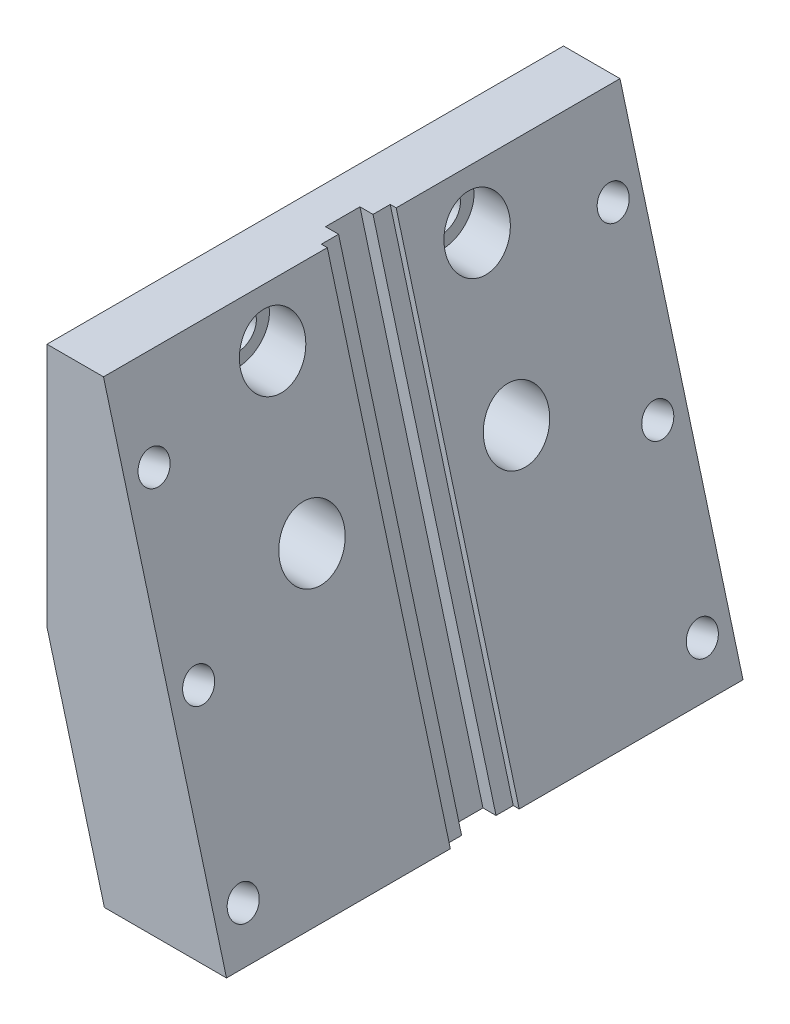
ISO-10303-21;
HEADER;
FILE_DESCRIPTION(('STEP AP214'),'2;1');
FILE_NAME('part.step','',(''),(''),'','','');
FILE_SCHEMA(('AUTOMOTIVE_DESIGN { 1 0 10303 214 1 1 1 1 }'));
ENDSEC;
DATA;
#1=APPLICATION_CONTEXT('core data for automotive mechanical design processes');
#2=APPLICATION_PROTOCOL_DEFINITION('international standard','automotive_design',2000,#1);
#3=PRODUCT_CONTEXT('',#1,'mechanical');
#4=PRODUCT('Part','Part','',(#3));
#5=PRODUCT_RELATED_PRODUCT_CATEGORY('part','',(#4));
#6=PRODUCT_DEFINITION_FORMATION('','',#4);
#7=PRODUCT_DEFINITION_CONTEXT('part definition',#1,'design');
#8=PRODUCT_DEFINITION('design','',#6,#7);
#9=PRODUCT_DEFINITION_SHAPE('','',#8);
#10=(LENGTH_UNIT() NAMED_UNIT(*) SI_UNIT(.MILLI.,.METRE.));
#11=(NAMED_UNIT(*) PLANE_ANGLE_UNIT() SI_UNIT($,.RADIAN.));
#12=(NAMED_UNIT(*) SI_UNIT($,.STERADIAN.) SOLID_ANGLE_UNIT());
#13=UNCERTAINTY_MEASURE_WITH_UNIT(LENGTH_MEASURE(1.E-05),#10,'distance_accuracy_value','');
#14=(GEOMETRIC_REPRESENTATION_CONTEXT(3) GLOBAL_UNCERTAINTY_ASSIGNED_CONTEXT((#13)) GLOBAL_UNIT_ASSIGNED_CONTEXT((#10,
#11,#12)) REPRESENTATION_CONTEXT('',''));
#15=CARTESIAN_POINT('',(0.,0.,0.));
#16=DIRECTION('',(0.,0.,1.));
#17=DIRECTION('',(1.,0.,0.));
#18=AXIS2_PLACEMENT_3D('',#15,#16,#17);
#19=CARTESIAN_POINT('',(-0.499999999999997,-4.26987298107783,8.89));
#20=DIRECTION('',(-1.,0.,0.));
#21=DIRECTION('',(0.,0.,1.));
#22=AXIS2_PLACEMENT_3D('',#19,#20,#21);
#23=CYLINDRICAL_SURFACE('',#22,1.63195);
#24=CARTESIAN_POINT('',(-10.5,-4.26987298107783,8.89));
#25=DIRECTION('',(1.,0.,0.));
#26=DIRECTION('',(0.,0.,-1.));
#27=AXIS2_PLACEMENT_3D('',#24,#25,#26);
#28=CIRCLE('',#27,1.63195);
#29=CARTESIAN_POINT('',(-10.5,-4.26987298107783,7.25805));
#30=VERTEX_POINT('',#29);
#31=EDGE_CURVE('E409',#30,#30,#28,.T.);
#32=ORIENTED_EDGE('',*,*,#31,.F.);
#33=EDGE_LOOP('',(#32));
#34=FACE_BOUND('',#33,.T.);
#35=CARTESIAN_POINT('',(-7.5,-4.26987298107783,8.89));
#36=DIRECTION('',(1.,0.,0.));
#37=DIRECTION('',(0.,0.,-1.));
#38=AXIS2_PLACEMENT_3D('',#35,#36,#37);
#39=CIRCLE('',#38,1.63195);
#40=CARTESIAN_POINT('',(-7.5,-4.26987298107783,7.25805));
#41=VERTEX_POINT('',#40);
#42=EDGE_CURVE('E425',#41,#41,#39,.T.);
#43=ORIENTED_EDGE('',*,*,#42,.T.);
#44=EDGE_LOOP('',(#43));
#45=FACE_BOUND('',#44,.T.);
#46=ADVANCED_FACE('F49',(#34,#45),#23,.F.);
#47=CARTESIAN_POINT('',(-0.499999999999997,-17.0698729810778,8.89));
#48=DIRECTION('',(-1.,0.,0.));
#49=DIRECTION('',(0.,0.,1.));
#50=AXIS2_PLACEMENT_3D('',#47,#48,#49);
#51=CYLINDRICAL_SURFACE('',#50,1.63195);
#52=CARTESIAN_POINT('',(-10.5,-17.0698729810778,8.89));
#53=DIRECTION('',(1.,0.,0.));
#54=DIRECTION('',(0.,0.,1.));
#55=AXIS2_PLACEMENT_3D('',#52,#53,#54);
#56=CIRCLE('',#55,1.63195);
#57=CARTESIAN_POINT('',(-10.5,-17.0698729810778,10.52195));
#58=VERTEX_POINT('',#57);
#59=EDGE_CURVE('E404',#58,#58,#56,.T.);
#60=ORIENTED_EDGE('',*,*,#59,.F.);
#61=EDGE_LOOP('',(#60));
#62=FACE_BOUND('',#61,.T.);
#63=CARTESIAN_POINT('',(-7.5,-17.0698729810778,8.89));
#64=DIRECTION('',(1.,0.,0.));
#65=DIRECTION('',(0.,0.,-1.));
#66=AXIS2_PLACEMENT_3D('',#63,#64,#65);
#67=CIRCLE('',#66,1.63195);
#68=CARTESIAN_POINT('',(-7.5,-17.0698729810778,7.25805));
#69=VERTEX_POINT('',#68);
#70=EDGE_CURVE('E421',#69,#69,#67,.T.);
#71=ORIENTED_EDGE('',*,*,#70,.T.);
#72=EDGE_LOOP('',(#71));
#73=FACE_BOUND('',#72,.T.);
#74=ADVANCED_FACE('F551',(#62,#73),#51,.F.);
#75=CARTESIAN_POINT('',(-0.499999999999997,-17.0698729810778,-8.89));
#76=DIRECTION('',(-1.,0.,0.));
#77=DIRECTION('',(0.,0.,1.));
#78=AXIS2_PLACEMENT_3D('',#75,#76,#77);
#79=CYLINDRICAL_SURFACE('',#78,1.63195);
#80=CARTESIAN_POINT('',(-10.5,-17.0698729810778,-8.89));
#81=DIRECTION('',(1.,0.,0.));
#82=DIRECTION('',(0.,0.,-1.));
#83=AXIS2_PLACEMENT_3D('',#80,#81,#82);
#84=CIRCLE('',#83,1.63195);
#85=CARTESIAN_POINT('',(-10.5,-17.0698729810778,-10.52195));
#86=VERTEX_POINT('',#85);
#87=EDGE_CURVE('E410',#86,#86,#84,.T.);
#88=ORIENTED_EDGE('',*,*,#87,.F.);
#89=EDGE_LOOP('',(#88));
#90=FACE_BOUND('',#89,.T.);
#91=CARTESIAN_POINT('',(-7.5,-17.0698729810778,-8.89));
#92=DIRECTION('',(1.,0.,0.));
#93=DIRECTION('',(0.,0.,-1.));
#94=AXIS2_PLACEMENT_3D('',#91,#92,#93);
#95=CIRCLE('',#94,1.63195);
#96=CARTESIAN_POINT('',(-7.5,-17.0698729810778,-10.52195));
#97=VERTEX_POINT('',#96);
#98=EDGE_CURVE('E426',#97,#97,#95,.T.);
#99=ORIENTED_EDGE('',*,*,#98,.T.);
#100=EDGE_LOOP('',(#99));
#101=FACE_BOUND('',#100,.T.);
#102=ADVANCED_FACE('F557',(#90,#101),#79,.F.);
#103=CARTESIAN_POINT('',(-0.499999999999997,-4.26987298107783,-8.89));
#104=DIRECTION('',(-1.,0.,0.));
#105=DIRECTION('',(0.,0.,1.));
#106=AXIS2_PLACEMENT_3D('',#103,#104,#105);
#107=CYLINDRICAL_SURFACE('',#106,1.63195);
#108=CARTESIAN_POINT('',(-10.5,-4.26987298107783,-8.89));
#109=DIRECTION('',(1.,0.,0.));
#110=DIRECTION('',(0.,0.,1.));
#111=AXIS2_PLACEMENT_3D('',#108,#109,#110);
#112=CIRCLE('',#111,1.63195);
#113=CARTESIAN_POINT('',(-10.5,-4.26987298107783,-7.25805));
#114=VERTEX_POINT('',#113);
#115=EDGE_CURVE('E359',#114,#114,#112,.T.);
#116=ORIENTED_EDGE('',*,*,#115,.F.);
#117=EDGE_LOOP('',(#116));
#118=FACE_BOUND('',#117,.T.);
#119=CARTESIAN_POINT('',(-7.5,-4.26987298107783,-8.89));
#120=DIRECTION('',(1.,0.,0.));
#121=DIRECTION('',(0.,0.,-1.));
#122=AXIS2_PLACEMENT_3D('',#119,#120,#121);
#123=CIRCLE('',#122,1.63195);
#124=CARTESIAN_POINT('',(-7.5,-4.26987298107783,-10.52195));
#125=VERTEX_POINT('',#124);
#126=EDGE_CURVE('E265',#125,#125,#123,.T.);
#127=ORIENTED_EDGE('',*,*,#126,.T.);
#128=EDGE_LOOP('',(#127));
#129=FACE_BOUND('',#128,.T.);
#130=ADVANCED_FACE('F565',(#118,#129),#107,.F.);
#131=CARTESIAN_POINT('',(-5.57695154586788,0.,0.));
#132=DIRECTION('',(0.965925826289066,0.258819045102528,0.));
#133=DIRECTION('',(0.,0.,1.));
#134=AXIS2_PLACEMENT_3D('',#131,#132,#133);
#135=PLANE('',#134);
#136=DIRECTION('',(-0.258819045102528,0.965925826289066,0.));
#137=VECTOR('',#136,1.);
#138=CARTESIAN_POINT('',(5.84903616136611,-42.6423666500534,-3.));
#139=LINE('',#138,#137);
#140=CARTESIAN_POINT('',(5.14101615137735,-40.,-3.));
#141=VERTEX_POINT('',#140);
#142=CARTESIAN_POINT('',(-5.57695154586788,0.,-3.));
#143=VERTEX_POINT('',#142);
#144=EDGE_CURVE('E198',#141,#143,#139,.T.);
#145=ORIENTED_EDGE('',*,*,#144,.F.);
#146=DIRECTION('',(0.,0.,1.));
#147=VECTOR('',#146,1.);
#148=CARTESIAN_POINT('',(5.14101615137735,-40.,0.));
#149=LINE('',#148,#147);
#150=CARTESIAN_POINT('',(5.14101615137734,-40.,-22.5));
#151=VERTEX_POINT('',#150);
#152=EDGE_CURVE('E214',#151,#141,#149,.T.);
#153=ORIENTED_EDGE('',*,*,#152,.F.);
#154=DIRECTION('',(0.258819045102528,-0.965925826289066,0.));
#155=VECTOR('',#154,1.);
#156=CARTESIAN_POINT('',(4.09326673973636,-36.0897459621556,-22.5));
#157=LINE('',#156,#155);
#158=CARTESIAN_POINT('',(-5.57695154586788,0.,-22.5));
#159=VERTEX_POINT('',#158);
#160=EDGE_CURVE('E234',#159,#151,#157,.T.);
#161=ORIENTED_EDGE('',*,*,#160,.F.);
#162=DIRECTION('',(0.,0.,-1.));
#163=VECTOR('',#162,1.);
#164=CARTESIAN_POINT('',(-5.57695154586788,0.,-22.5));
#165=LINE('',#164,#163);
#166=EDGE_CURVE('E215',#143,#159,#165,.T.);
#167=ORIENTED_EDGE('',*,*,#166,.F.);
#168=EDGE_LOOP('',(#145,#153,#161,#167));
#169=FACE_BOUND('',#168,.T.);
#170=CARTESIAN_POINT('',(-1.00215576247691,-17.0733702978664,-8.91));
#171=DIRECTION('',(0.965925826289066,0.258819045102528,0.));
#172=DIRECTION('',(0.258819045102528,-0.965925826289066,0.));
#173=AXIS2_PLACEMENT_3D('',#170,#171,#172);
#174=ELLIPSE('',#173,2.89256164806578,2.794);
#175=CARTESIAN_POINT('',(-0.253505718824335,-19.8673702978664,-8.91));
#176=VERTEX_POINT('',#175);
#177=EDGE_CURVE('E354',#176,#176,#174,.F.);
#178=ORIENTED_EDGE('',*,*,#177,.T.);
#179=EDGE_LOOP('',(#178));
#180=FACE_BOUND('',#179,.T.);
#181=CARTESIAN_POINT('',(-4.43284252880457,-4.26987298107784,-8.91));
#182=DIRECTION('',(0.965925826289066,0.258819045102528,0.));
#183=DIRECTION('',(0.258819045102528,-0.965925826289066,0.));
#184=AXIS2_PLACEMENT_3D('',#181,#182,#183);
#185=ELLIPSE('',#184,2.89256164806578,2.794);
#186=CARTESIAN_POINT('',(-3.68419248515199,-7.06387298107784,-8.91));
#187=VERTEX_POINT('',#186);
#188=EDGE_CURVE('E360',#187,#187,#185,.F.);
#189=ORIENTED_EDGE('',*,*,#188,.T.);
#190=EDGE_LOOP('',(#189));
#191=FACE_BOUND('',#190,.T.);
#192=CARTESIAN_POINT('',(0.213779508295674,-21.6113025071054,-20.));
#193=DIRECTION('',(0.965925826289069,0.258819045102519,0.));
#194=DIRECTION('',(-0.258819045102519,0.965925826289069,0.));
#195=AXIS2_PLACEMENT_3D('',#192,#193,#194);
#196=CIRCLE('',#195,1.35255);
#197=CARTESIAN_POINT('',(-0.136286191157738,-20.3048395307581,-20.));
#198=VERTEX_POINT('',#197);
#199=EDGE_CURVE('E371',#198,#198,#196,.T.);
#200=ORIENTED_EDGE('',*,*,#199,.F.);
#201=EDGE_LOOP('',(#200));
#202=FACE_BOUND('',#201,.T.);
#203=CARTESIAN_POINT('',(4.09606518483345,-36.1001899014415,-20.));
#204=DIRECTION('',(0.965925826289069,0.258819045102519,0.));
#205=DIRECTION('',(-0.258819045102519,0.965925826289069,0.));
#206=AXIS2_PLACEMENT_3D('',#203,#204,#205);
#207=CIRCLE('',#206,1.35255);
#208=CARTESIAN_POINT('',(3.74599948538004,-34.7937269250942,-20.));
#209=VERTEX_POINT('',#208);
#210=EDGE_CURVE('E911',#209,#209,#207,.T.);
#211=ORIENTED_EDGE('',*,*,#210,.F.);
#212=EDGE_LOOP('',(#211));
#213=FACE_BOUND('',#212,.T.);
#214=CARTESIAN_POINT('',(-3.6685061682421,-7.12241511276939,-20.));
#215=DIRECTION('',(0.965925826289069,0.258819045102519,0.));
#216=DIRECTION('',(-0.258819045102519,0.965925826289069,0.));
#217=AXIS2_PLACEMENT_3D('',#214,#215,#216);
#218=CIRCLE('',#217,1.35255);
#219=CARTESIAN_POINT('',(-4.01857186769552,-5.81595213642211,-20.));
#220=VERTEX_POINT('',#219);
#221=EDGE_CURVE('E900',#220,#220,#218,.T.);
#222=ORIENTED_EDGE('',*,*,#221,.F.);
#223=EDGE_LOOP('',(#222));
#224=FACE_BOUND('',#223,.T.);
#225=ADVANCED_FACE('F211',(#169,#180,#191,#202,#213,#224),#135,.T.);
#226=CARTESIAN_POINT('',(-10.5,-40.,22.5));
#227=DIRECTION('',(0.,0.,1.));
#228=DIRECTION('',(1.,0.,0.));
#229=AXIS2_PLACEMENT_3D('',#226,#227,#228);
#230=PLANE('',#229);
#231=DIRECTION('',(0.,1.,0.));
#232=VECTOR('',#231,1.);
#233=CARTESIAN_POINT('',(-10.5,-40.,22.5));
#234=LINE('',#233,#232);
#235=CARTESIAN_POINT('',(-10.5,-21.3397459621557,22.5));
#236=VERTEX_POINT('',#235);
#237=CARTESIAN_POINT('',(-10.5,0.,22.5));
#238=VERTEX_POINT('',#237);
#239=EDGE_CURVE('E918',#236,#238,#234,.T.);
#240=ORIENTED_EDGE('',*,*,#239,.F.);
#241=DIRECTION('',(-0.258819045102522,0.965925826289068,0.));
#242=VECTOR('',#241,1.);
#243=CARTESIAN_POINT('',(-5.8349364905389,-38.75,22.5));
#244=LINE('',#243,#242);
#245=CARTESIAN_POINT('',(-5.49999999999999,-40.,22.5));
#246=VERTEX_POINT('',#245);
#247=EDGE_CURVE('E259',#236,#246,#244,.F.);
#248=ORIENTED_EDGE('',*,*,#247,.T.);
#249=DIRECTION('',(1.,0.,0.));
#250=VECTOR('',#249,1.);
#251=CARTESIAN_POINT('',(-10.5,-40.,22.5));
#252=LINE('',#251,#250);
#253=CARTESIAN_POINT('',(5.14101615137734,-40.,22.5));
#254=VERTEX_POINT('',#253);
#255=EDGE_CURVE('E281',#246,#254,#252,.T.);
#256=ORIENTED_EDGE('',*,*,#255,.T.);
#257=DIRECTION('',(-0.258819045102528,0.965925826289066,0.));
#258=VECTOR('',#257,1.);
#259=CARTESIAN_POINT('',(4.09326673973636,-36.0897459621556,22.5));
#260=LINE('',#259,#258);
#261=CARTESIAN_POINT('',(-5.57695154586788,0.,22.5));
#262=VERTEX_POINT('',#261);
#263=EDGE_CURVE('E225',#254,#262,#260,.T.);
#264=ORIENTED_EDGE('',*,*,#263,.T.);
#265=DIRECTION('',(1.,0.,0.));
#266=VECTOR('',#265,1.);
#267=CARTESIAN_POINT('',(-10.5,0.,22.5));
#268=LINE('',#267,#266);
#269=EDGE_CURVE('E287',#238,#262,#268,.T.);
#270=ORIENTED_EDGE('',*,*,#269,.F.);
#271=EDGE_LOOP('',(#240,#248,#256,#264,#270));
#272=FACE_BOUND('',#271,.T.);
#273=ADVANCED_FACE('F626',(#272),#230,.T.);
#274=CARTESIAN_POINT('',(-10.5,-40.,22.5));
#275=DIRECTION('',(-1.,0.,0.));
#276=DIRECTION('',(0.,0.,1.));
#277=AXIS2_PLACEMENT_3D('',#274,#275,#276);
#278=PLANE('',#277);
#279=ORIENTED_EDGE('',*,*,#115,.T.);
#280=EDGE_LOOP('',(#279));
#281=FACE_BOUND('',#280,.T.);
#282=ORIENTED_EDGE('',*,*,#87,.T.);
#283=EDGE_LOOP('',(#282));
#284=FACE_BOUND('',#283,.T.);
#285=ORIENTED_EDGE('',*,*,#59,.T.);
#286=EDGE_LOOP('',(#285));
#287=FACE_BOUND('',#286,.T.);
#288=ORIENTED_EDGE('',*,*,#31,.T.);
#289=EDGE_LOOP('',(#288));
#290=FACE_BOUND('',#289,.T.);
#291=CARTESIAN_POINT('',(-10.5,-8.9529083680871,20.));
#292=DIRECTION('',(-1.,0.,0.));
#293=DIRECTION('',(0.,1.,0.));
#294=AXIS2_PLACEMENT_3D('',#291,#292,#293);
#295=ELLIPSE('',#294,1.40026279781366,1.35255);
#296=CARTESIAN_POINT('',(-10.5,-7.55264557027344,20.));
#297=VERTEX_POINT('',#296);
#298=EDGE_CURVE('E965',#297,#297,#295,.T.);
#299=ORIENTED_EDGE('',*,*,#298,.F.);
#300=EDGE_LOOP('',(#299));
#301=FACE_BOUND('',#300,.T.);
#302=CARTESIAN_POINT('',(-10.5,-8.9529083680871,-20.));
#303=DIRECTION('',(-1.,0.,0.));
#304=DIRECTION('',(0.,1.,0.));
#305=AXIS2_PLACEMENT_3D('',#302,#303,#304);
#306=ELLIPSE('',#305,1.40026279781366,1.35255);
#307=CARTESIAN_POINT('',(-10.5,-7.55264557027344,-20.));
#308=VERTEX_POINT('',#307);
#309=EDGE_CURVE('E862',#308,#308,#306,.T.);
#310=ORIENTED_EDGE('',*,*,#309,.F.);
#311=EDGE_LOOP('',(#310));
#312=FACE_BOUND('',#311,.T.);
#313=DIRECTION('',(0.,1.,0.));
#314=VECTOR('',#313,1.);
#315=CARTESIAN_POINT('',(-10.5,-40.,-22.5));
#316=LINE('',#315,#314);
#317=CARTESIAN_POINT('',(-10.5,-21.3397459621557,-22.5));
#318=VERTEX_POINT('',#317);
#319=CARTESIAN_POINT('',(-10.5,0.,-22.5));
#320=VERTEX_POINT('',#319);
#321=EDGE_CURVE('E921',#318,#320,#316,.T.);
#322=ORIENTED_EDGE('',*,*,#321,.F.);
#323=DIRECTION('',(0.,0.,1.));
#324=VECTOR('',#323,1.);
#325=CARTESIAN_POINT('',(-10.5,-21.3397459621557,22.5));
#326=LINE('',#325,#324);
#327=EDGE_CURVE('E294',#318,#236,#326,.T.);
#328=ORIENTED_EDGE('',*,*,#327,.T.);
#329=ORIENTED_EDGE('',*,*,#239,.T.);
#330=DIRECTION('',(0.,0.,1.));
#331=VECTOR('',#330,1.);
#332=CARTESIAN_POINT('',(-10.5,0.,22.5));
#333=LINE('',#332,#331);
#334=EDGE_CURVE('E279',#320,#238,#333,.T.);
#335=ORIENTED_EDGE('',*,*,#334,.F.);
#336=EDGE_LOOP('',(#322,#328,#329,#335));
#337=FACE_BOUND('',#336,.T.);
#338=ADVANCED_FACE('F629',(#281,#284,#287,#290,#301,#312,#337),#278,.T.);
#339=CARTESIAN_POINT('',(-10.5,-40.,-22.5));
#340=DIRECTION('',(0.,0.,-1.));
#341=DIRECTION('',(-1.,0.,0.));
#342=AXIS2_PLACEMENT_3D('',#339,#340,#341);
#343=PLANE('',#342);
#344=DIRECTION('',(-1.,0.,0.));
#345=VECTOR('',#344,1.);
#346=CARTESIAN_POINT('',(-10.5,-40.,-22.5));
#347=LINE('',#346,#345);
#348=CARTESIAN_POINT('',(-5.49999999999999,-40.,-22.5));
#349=VERTEX_POINT('',#348);
#350=EDGE_CURVE('E223',#151,#349,#347,.T.);
#351=ORIENTED_EDGE('',*,*,#350,.T.);
#352=DIRECTION('',(0.258819045102522,-0.965925826289068,0.));
#353=VECTOR('',#352,1.);
#354=CARTESIAN_POINT('',(-5.8349364905389,-38.75,-22.5));
#355=LINE('',#354,#353);
#356=EDGE_CURVE('E258',#349,#318,#355,.F.);
#357=ORIENTED_EDGE('',*,*,#356,.T.);
#358=ORIENTED_EDGE('',*,*,#321,.T.);
#359=DIRECTION('',(-1.,0.,0.));
#360=VECTOR('',#359,1.);
#361=CARTESIAN_POINT('',(-10.5,0.,-22.5));
#362=LINE('',#361,#360);
#363=EDGE_CURVE('E273',#159,#320,#362,.T.);
#364=ORIENTED_EDGE('',*,*,#363,.F.);
#365=ORIENTED_EDGE('',*,*,#160,.T.);
#366=EDGE_LOOP('',(#351,#357,#358,#364,#365));
#367=FACE_BOUND('',#366,.T.);
#368=ADVANCED_FACE('F623',(#367),#343,.T.);
#369=CARTESIAN_POINT('',(0.,-40.,0.));
#370=DIRECTION('',(0.,-1.,0.));
#371=DIRECTION('',(0.,0.,-1.));
#372=AXIS2_PLACEMENT_3D('',#369,#370,#371);
#373=PLANE('',#372);
#374=DIRECTION('',(-1.,0.,0.));
#375=VECTOR('',#374,1.);
#376=CARTESIAN_POINT('',(0.,-40.,3.));
#377=LINE('',#376,#375);
#378=CARTESIAN_POINT('',(5.14101615137738,-40.0000000000001,3.));
#379=VERTEX_POINT('',#378);
#380=CARTESIAN_POINT('',(4.62337806117231,-40.,3.));
#381=VERTEX_POINT('',#380);
#382=EDGE_CURVE('E205',#379,#381,#377,.T.);
#383=ORIENTED_EDGE('',*,*,#382,.F.);
#384=EDGE_CURVE('E226',#379,#254,#149,.T.);
#385=ORIENTED_EDGE('',*,*,#384,.T.);
#386=ORIENTED_EDGE('',*,*,#255,.F.);
#387=DIRECTION('',(0.,0.,-1.));
#388=VECTOR('',#387,1.);
#389=CARTESIAN_POINT('',(-5.49999999999999,-40.,0.));
#390=LINE('',#389,#388);
#391=EDGE_CURVE('E253',#246,#349,#390,.T.);
#392=ORIENTED_EDGE('',*,*,#391,.T.);
#393=ORIENTED_EDGE('',*,*,#350,.F.);
#394=ORIENTED_EDGE('',*,*,#152,.T.);
#395=DIRECTION('',(1.,0.,0.));
#396=VECTOR('',#395,1.);
#397=CARTESIAN_POINT('',(0.,-40.,-3.));
#398=LINE('',#397,#396);
#399=CARTESIAN_POINT('',(4.62337806117231,-40.,-3.));
#400=VERTEX_POINT('',#399);
#401=EDGE_CURVE('E194',#400,#141,#398,.T.);
#402=ORIENTED_EDGE('',*,*,#401,.F.);
#403=DIRECTION('',(0.,0.,-1.));
#404=VECTOR('',#403,1.);
#405=CARTESIAN_POINT('',(4.62337806117231,-40.,0.));
#406=LINE('',#405,#404);
#407=CARTESIAN_POINT('',(4.62337806117234,-40.0000000000001,-1.5));
#408=VERTEX_POINT('',#407);
#409=EDGE_CURVE('E334',#408,#400,#406,.T.);
#410=ORIENTED_EDGE('',*,*,#409,.F.);
#411=DIRECTION('',(1.,0.,0.));
#412=VECTOR('',#411,1.);
#413=CARTESIAN_POINT('',(0.,-40.,-1.5));
#414=LINE('',#413,#412);
#415=CARTESIAN_POINT('',(3.48457426272081,-40.,-1.5));
#416=VERTEX_POINT('',#415);
#417=EDGE_CURVE('E315',#416,#408,#414,.T.);
#418=ORIENTED_EDGE('',*,*,#417,.F.);
#419=DIRECTION('',(0.,0.,-1.));
#420=VECTOR('',#419,1.);
#421=CARTESIAN_POINT('',(3.4845742627208,-40.,0.));
#422=LINE('',#421,#420);
#423=CARTESIAN_POINT('',(3.48457426272081,-40.,1.5));
#424=VERTEX_POINT('',#423);
#425=EDGE_CURVE('E280',#424,#416,#422,.T.);
#426=ORIENTED_EDGE('',*,*,#425,.F.);
#427=DIRECTION('',(-1.,0.,0.));
#428=VECTOR('',#427,1.);
#429=CARTESIAN_POINT('',(0.,-40.,1.5));
#430=LINE('',#429,#428);
#431=CARTESIAN_POINT('',(4.62337806117231,-40.,1.5));
#432=VERTEX_POINT('',#431);
#433=EDGE_CURVE('E316',#432,#424,#430,.T.);
#434=ORIENTED_EDGE('',*,*,#433,.F.);
#435=EDGE_CURVE('E82',#381,#432,#406,.T.);
#436=ORIENTED_EDGE('',*,*,#435,.F.);
#437=EDGE_LOOP('',(#383,#385,#386,#392,#393,#394,#402,#410,#418,#426,#434,#436));
#438=FACE_BOUND('',#437,.T.);
#439=ADVANCED_FACE('F221',(#438),#373,.T.);
#440=CARTESIAN_POINT('',(0.,0.,0.));
#441=DIRECTION('',(0.,-1.,0.));
#442=DIRECTION('',(0.,0.,-1.));
#443=AXIS2_PLACEMENT_3D('',#440,#441,#442);
#444=PLANE('',#443);
#445=CARTESIAN_POINT('',(-5.57695154586788,0.,3.));
#446=VERTEX_POINT('',#445);
#447=EDGE_CURVE('E924',#262,#446,#165,.T.);
#448=ORIENTED_EDGE('',*,*,#447,.T.);
#449=DIRECTION('',(-1.,0.,0.));
#450=VECTOR('',#449,1.);
#451=CARTESIAN_POINT('',(0.,0.,3.));
#452=LINE('',#451,#450);
#453=CARTESIAN_POINT('',(-6.09458963607292,0.,3.));
#454=VERTEX_POINT('',#453);
#455=EDGE_CURVE('E341',#446,#454,#452,.T.);
#456=ORIENTED_EDGE('',*,*,#455,.T.);
#457=DIRECTION('',(0.,0.,-1.));
#458=VECTOR('',#457,1.);
#459=CARTESIAN_POINT('',(-6.09458963607293,0.,0.));
#460=LINE('',#459,#458);
#461=CARTESIAN_POINT('',(-6.09458963607293,0.,1.5));
#462=VERTEX_POINT('',#461);
#463=EDGE_CURVE('E333',#454,#462,#460,.T.);
#464=ORIENTED_EDGE('',*,*,#463,.T.);
#465=DIRECTION('',(-1.,0.,0.));
#466=VECTOR('',#465,1.);
#467=CARTESIAN_POINT('',(0.,0.,1.5));
#468=LINE('',#467,#466);
#469=CARTESIAN_POINT('',(-7.233393434524,0.,1.5));
#470=VERTEX_POINT('',#469);
#471=EDGE_CURVE('E868',#462,#470,#468,.T.);
#472=ORIENTED_EDGE('',*,*,#471,.T.);
#473=DIRECTION('',(0.,0.,-1.));
#474=VECTOR('',#473,1.);
#475=CARTESIAN_POINT('',(-7.233393434524,0.,0.));
#476=LINE('',#475,#474);
#477=CARTESIAN_POINT('',(-7.233393434524,0.,-1.5));
#478=VERTEX_POINT('',#477);
#479=EDGE_CURVE('E231',#470,#478,#476,.T.);
#480=ORIENTED_EDGE('',*,*,#479,.T.);
#481=DIRECTION('',(1.,0.,0.));
#482=VECTOR('',#481,1.);
#483=CARTESIAN_POINT('',(0.,0.,-1.5));
#484=LINE('',#483,#482);
#485=CARTESIAN_POINT('',(-6.09458963607293,0.,-1.5));
#486=VERTEX_POINT('',#485);
#487=EDGE_CURVE('E310',#478,#486,#484,.T.);
#488=ORIENTED_EDGE('',*,*,#487,.T.);
#489=CARTESIAN_POINT('',(-6.09458963607292,0.,-3.));
#490=VERTEX_POINT('',#489);
#491=EDGE_CURVE('E70',#486,#490,#460,.T.);
#492=ORIENTED_EDGE('',*,*,#491,.T.);
#493=DIRECTION('',(1.,0.,0.));
#494=VECTOR('',#493,1.);
#495=CARTESIAN_POINT('',(0.,0.,-3.));
#496=LINE('',#495,#494);
#497=EDGE_CURVE('E13',#490,#143,#496,.T.);
#498=ORIENTED_EDGE('',*,*,#497,.T.);
#499=ORIENTED_EDGE('',*,*,#166,.T.);
#500=ORIENTED_EDGE('',*,*,#363,.T.);
#501=ORIENTED_EDGE('',*,*,#334,.T.);
#502=ORIENTED_EDGE('',*,*,#269,.T.);
#503=EDGE_LOOP('',(#448,#456,#464,#472,#480,#488,#492,#498,#499,#500,#501,#502));
#504=FACE_BOUND('',#503,.T.);
#505=ADVANCED_FACE('F622',(#504),#444,.F.);
#506=DIRECTION('',(0.258819045102528,-0.965925826289066,0.));
#507=VECTOR('',#506,1.);
#508=CARTESIAN_POINT('',(5.84903616136611,-42.6423666500534,3.));
#509=LINE('',#508,#507);
#510=EDGE_CURVE('E216',#446,#379,#509,.T.);
#511=ORIENTED_EDGE('',*,*,#510,.F.);
#512=ORIENTED_EDGE('',*,*,#447,.F.);
#513=ORIENTED_EDGE('',*,*,#263,.F.);
#514=ORIENTED_EDGE('',*,*,#384,.F.);
#515=EDGE_LOOP('',(#511,#512,#513,#514));
#516=FACE_BOUND('',#515,.T.);
#517=CARTESIAN_POINT('',(-1.00215576247691,-17.0733702978664,8.91));
#518=DIRECTION('',(0.965925826289066,0.258819045102528,0.));
#519=DIRECTION('',(0.258819045102528,-0.965925826289066,0.));
#520=AXIS2_PLACEMENT_3D('',#517,#518,#519);
#521=ELLIPSE('',#520,2.89256164806578,2.794);
#522=CARTESIAN_POINT('',(-0.253505718824335,-19.8673702978664,8.91));
#523=VERTEX_POINT('',#522);
#524=EDGE_CURVE('E436',#523,#523,#521,.F.);
#525=ORIENTED_EDGE('',*,*,#524,.T.);
#526=EDGE_LOOP('',(#525));
#527=FACE_BOUND('',#526,.T.);
#528=CARTESIAN_POINT('',(-4.43284252880457,-4.26987298107784,8.91));
#529=DIRECTION('',(0.965925826289066,0.258819045102528,0.));
#530=DIRECTION('',(0.258819045102528,-0.965925826289066,0.));
#531=AXIS2_PLACEMENT_3D('',#528,#529,#530);
#532=ELLIPSE('',#531,2.89256164806578,2.794);
#533=CARTESIAN_POINT('',(-3.68419248515199,-7.06387298107784,8.91));
#534=VERTEX_POINT('',#533);
#535=EDGE_CURVE('E432',#534,#534,#532,.F.);
#536=ORIENTED_EDGE('',*,*,#535,.T.);
#537=EDGE_LOOP('',(#536));
#538=FACE_BOUND('',#537,.T.);
#539=CARTESIAN_POINT('',(0.213779508295674,-21.6113025071054,20.));
#540=DIRECTION('',(0.965925826289069,0.258819045102519,0.));
#541=DIRECTION('',(-0.258819045102519,0.965925826289069,0.));
#542=AXIS2_PLACEMENT_3D('',#539,#540,#541);
#543=CIRCLE('',#542,1.35255);
#544=CARTESIAN_POINT('',(-0.136286191157738,-20.3048395307581,20.));
#545=VERTEX_POINT('',#544);
#546=EDGE_CURVE('E444',#545,#545,#543,.T.);
#547=ORIENTED_EDGE('',*,*,#546,.F.);
#548=EDGE_LOOP('',(#547));
#549=FACE_BOUND('',#548,.T.);
#550=CARTESIAN_POINT('',(-3.6685061682421,-7.12241511276939,20.));
#551=DIRECTION('',(0.965925826289069,0.258819045102519,0.));
#552=DIRECTION('',(-0.258819045102519,0.965925826289069,0.));
#553=AXIS2_PLACEMENT_3D('',#550,#551,#552);
#554=CIRCLE('',#553,1.35255);
#555=CARTESIAN_POINT('',(-4.01857186769552,-5.81595213642211,20.));
#556=VERTEX_POINT('',#555);
#557=EDGE_CURVE('E385',#556,#556,#554,.T.);
#558=ORIENTED_EDGE('',*,*,#557,.F.);
#559=EDGE_LOOP('',(#558));
#560=FACE_BOUND('',#559,.T.);
#561=CARTESIAN_POINT('',(4.09606518483345,-36.1001899014415,20.));
#562=DIRECTION('',(0.965925826289069,0.258819045102519,0.));
#563=DIRECTION('',(-0.258819045102519,0.965925826289069,0.));
#564=AXIS2_PLACEMENT_3D('',#561,#562,#563);
#565=CIRCLE('',#564,1.35255);
#566=CARTESIAN_POINT('',(3.74599948538004,-34.7937269250942,20.));
#567=VERTEX_POINT('',#566);
#568=EDGE_CURVE('E850',#567,#567,#565,.T.);
#569=ORIENTED_EDGE('',*,*,#568,.F.);
#570=EDGE_LOOP('',(#569));
#571=FACE_BOUND('',#570,.T.);
#572=ADVANCED_FACE('F612',(#516,#527,#538,#549,#560,#571),#135,.T.);
#573=CARTESIAN_POINT('',(-6.74884795219469,-1.80834835863099,0.));
#574=DIRECTION('',(-0.965925826289069,-0.258819045102518,0.));
#575=DIRECTION('',(0.258819045102518,-0.965925826289069,0.));
#576=AXIS2_PLACEMENT_3D('',#573,#574,#575);
#577=PLANE('',#576);
#578=ORIENTED_EDGE('',*,*,#425,.T.);
#579=DIRECTION('',(-0.258819045102518,0.965925826289069,0.));
#580=VECTOR('',#579,1.);
#581=CARTESIAN_POINT('',(4.0599794954987,-42.1474415636681,-1.5));
#582=LINE('',#581,#580);
#583=EDGE_CURVE('E856',#416,#478,#582,.T.);
#584=ORIENTED_EDGE('',*,*,#583,.T.);
#585=ORIENTED_EDGE('',*,*,#479,.F.);
#586=DIRECTION('',(0.258819045102518,-0.965925826289069,0.));
#587=VECTOR('',#586,1.);
#588=CARTESIAN_POINT('',(4.0599794954987,-42.1474415636681,1.5));
#589=LINE('',#588,#587);
#590=EDGE_CURVE('E861',#470,#424,#589,.T.);
#591=ORIENTED_EDGE('',*,*,#590,.T.);
#592=EDGE_LOOP('',(#578,#584,#585,#591));
#593=FACE_BOUND('',#592,.T.);
#594=ADVANCED_FACE('F608',(#593),#577,.F.);
#595=CARTESIAN_POINT('',(4.0599794954987,-42.1474415636681,-1.5));
#596=DIRECTION('',(0.,0.,-1.));
#597=DIRECTION('',(-1.,0.,0.));
#598=AXIS2_PLACEMENT_3D('',#595,#596,#597);
#599=PLANE('',#598);
#600=ORIENTED_EDGE('',*,*,#417,.T.);
#601=DIRECTION('',(-0.258819045102528,0.965925826289066,0.));
#602=VECTOR('',#601,1.);
#603=CARTESIAN_POINT('',(5.12249790441708,-41.8627406140552,-1.5));
#604=LINE('',#603,#602);
#605=EDGE_CURVE('E332',#408,#486,#604,.T.);
#606=ORIENTED_EDGE('',*,*,#605,.T.);
#607=ORIENTED_EDGE('',*,*,#487,.F.);
#608=ORIENTED_EDGE('',*,*,#583,.F.);
#609=EDGE_LOOP('',(#600,#606,#607,#608));
#610=FACE_BOUND('',#609,.T.);
#611=ADVANCED_FACE('F611',(#610),#599,.F.);
#612=CARTESIAN_POINT('',(4.0599794954987,-42.1474415636681,1.5));
#613=DIRECTION('',(0.,0.,1.));
#614=DIRECTION('',(1.,0.,0.));
#615=AXIS2_PLACEMENT_3D('',#612,#613,#614);
#616=PLANE('',#615);
#617=ORIENTED_EDGE('',*,*,#471,.F.);
#618=DIRECTION('',(0.258819045102528,-0.965925826289066,0.));
#619=VECTOR('',#618,1.);
#620=CARTESIAN_POINT('',(5.12249790441708,-41.8627406140552,1.5));
#621=LINE('',#620,#619);
#622=EDGE_CURVE('E59',#462,#432,#621,.T.);
#623=ORIENTED_EDGE('',*,*,#622,.T.);
#624=ORIENTED_EDGE('',*,*,#433,.T.);
#625=ORIENTED_EDGE('',*,*,#590,.F.);
#626=EDGE_LOOP('',(#617,#623,#624,#625));
#627=FACE_BOUND('',#626,.T.);
#628=ADVANCED_FACE('F606',(#627),#616,.F.);
#629=CARTESIAN_POINT('',(-3.6685061682421,-7.12241511276939,-20.));
#630=DIRECTION('',(0.965925826289069,0.258819045102519,0.));
#631=DIRECTION('',(-0.258819045102519,0.965925826289069,0.));
#632=AXIS2_PLACEMENT_3D('',#629,#630,#631);
#633=CYLINDRICAL_SURFACE('',#632,1.35255);
#634=ORIENTED_EDGE('',*,*,#309,.T.);
#635=EDGE_LOOP('',(#634));
#636=FACE_BOUND('',#635,.T.);
#637=ORIENTED_EDGE('',*,*,#221,.T.);
#638=EDGE_LOOP('',(#637));
#639=FACE_BOUND('',#638,.T.);
#640=ADVANCED_FACE('F602',(#636,#639),#633,.F.);
#641=CARTESIAN_POINT('',(-4.59726725176817,-38.4295613073641,-20.));
#642=DIRECTION('',(0.965925826289069,0.258819045102519,0.));
#643=DIRECTION('',(-0.258819045102519,0.965925826289069,0.));
#644=AXIS2_PLACEMENT_3D('',#641,#642,#643);
#645=CONICAL_SURFACE('',#644,1.35255,1.02974425867665);
#646=CARTESIAN_POINT('',(-5.38226940447279,-38.639902000238,-20.));
#647=VERTEX_POINT('',#646);
#648=VERTEX_LOOP('',#647);
#649=FACE_BOUND('',#648,.T.);
#650=CARTESIAN_POINT('',(-4.59726725176817,-38.4295613073641,-20.));
#651=DIRECTION('',(0.965925826289069,0.258819045102519,0.));
#652=DIRECTION('',(-0.258819045102519,0.965925826289069,0.));
#653=AXIS2_PLACEMENT_3D('',#650,#651,#652);
#654=CIRCLE('',#653,1.35255);
#655=CARTESIAN_POINT('',(-4.94733295122158,-37.1230983310169,-20.));
#656=VERTEX_POINT('',#655);
#657=EDGE_CURVE('E902',#656,#656,#654,.T.);
#658=ORIENTED_EDGE('',*,*,#657,.T.);
#659=EDGE_LOOP('',(#658));
#660=FACE_BOUND('',#659,.T.);
#661=ADVANCED_FACE('F598',(#649,#660),#645,.F.);
#662=CARTESIAN_POINT('',(4.09606518483345,-36.1001899014415,-20.));
#663=DIRECTION('',(0.965925826289069,0.258819045102519,0.));
#664=DIRECTION('',(-0.258819045102519,0.965925826289069,0.));
#665=AXIS2_PLACEMENT_3D('',#662,#663,#664);
#666=CYLINDRICAL_SURFACE('',#665,1.35255);
#667=ORIENTED_EDGE('',*,*,#657,.F.);
#668=EDGE_LOOP('',(#667));
#669=FACE_BOUND('',#668,.T.);
#670=ORIENTED_EDGE('',*,*,#210,.T.);
#671=EDGE_LOOP('',(#670));
#672=FACE_BOUND('',#671,.T.);
#673=ADVANCED_FACE('F594',(#669,#672),#666,.F.);
#674=CARTESIAN_POINT('',(-4.59726725176817,-38.4295613073641,20.));
#675=DIRECTION('',(0.965925826289069,0.258819045102519,0.));
#676=DIRECTION('',(-0.258819045102519,0.965925826289069,0.));
#677=AXIS2_PLACEMENT_3D('',#674,#675,#676);
#678=CONICAL_SURFACE('',#677,1.35255,1.02974425867665);
#679=CARTESIAN_POINT('',(-5.38226940447279,-38.639902000238,20.));
#680=VERTEX_POINT('',#679);
#681=VERTEX_LOOP('',#680);
#682=FACE_BOUND('',#681,.T.);
#683=CARTESIAN_POINT('',(-4.59726725176817,-38.4295613073641,20.));
#684=DIRECTION('',(0.965925826289069,0.258819045102519,0.));
#685=DIRECTION('',(-0.258819045102519,0.965925826289069,0.));
#686=AXIS2_PLACEMENT_3D('',#683,#684,#685);
#687=CIRCLE('',#686,1.35255);
#688=CARTESIAN_POINT('',(-4.94733295122158,-37.1230983310169,20.));
#689=VERTEX_POINT('',#688);
#690=EDGE_CURVE('E1028',#689,#689,#687,.T.);
#691=ORIENTED_EDGE('',*,*,#690,.T.);
#692=EDGE_LOOP('',(#691));
#693=FACE_BOUND('',#692,.T.);
#694=ADVANCED_FACE('F590',(#682,#693),#678,.F.);
#695=CARTESIAN_POINT('',(4.09606518483345,-36.1001899014415,20.));
#696=DIRECTION('',(0.965925826289069,0.258819045102519,0.));
#697=DIRECTION('',(-0.258819045102519,0.965925826289069,0.));
#698=AXIS2_PLACEMENT_3D('',#695,#696,#697);
#699=CYLINDRICAL_SURFACE('',#698,1.35255);
#700=ORIENTED_EDGE('',*,*,#690,.F.);
#701=EDGE_LOOP('',(#700));
#702=FACE_BOUND('',#701,.T.);
#703=ORIENTED_EDGE('',*,*,#568,.T.);
#704=EDGE_LOOP('',(#703));
#705=FACE_BOUND('',#704,.T.);
#706=ADVANCED_FACE('F586',(#702,#705),#699,.F.);
#707=CARTESIAN_POINT('',(-3.6685061682421,-7.12241511276939,20.));
#708=DIRECTION('',(0.965925826289069,0.258819045102519,0.));
#709=DIRECTION('',(-0.258819045102519,0.965925826289069,0.));
#710=AXIS2_PLACEMENT_3D('',#707,#708,#709);
#711=CYLINDRICAL_SURFACE('',#710,1.35255);
#712=ORIENTED_EDGE('',*,*,#298,.T.);
#713=EDGE_LOOP('',(#712));
#714=FACE_BOUND('',#713,.T.);
#715=ORIENTED_EDGE('',*,*,#557,.T.);
#716=EDGE_LOOP('',(#715));
#717=FACE_BOUND('',#716,.T.);
#718=ADVANCED_FACE('F582',(#714,#717),#711,.F.);
#719=CARTESIAN_POINT('',(-8.47955292830595,-23.9406739130281,-20.));
#720=DIRECTION('',(0.965925826289069,0.258819045102519,0.));
#721=DIRECTION('',(-0.258819045102519,0.965925826289069,0.));
#722=AXIS2_PLACEMENT_3D('',#719,#720,#721);
#723=CONICAL_SURFACE('',#722,1.35255,1.02974425867665);
#724=CARTESIAN_POINT('',(-9.26455508101057,-24.151014605902,-20.));
#725=VERTEX_POINT('',#724);
#726=VERTEX_LOOP('',#725);
#727=FACE_BOUND('',#726,.T.);
#728=CARTESIAN_POINT('',(-8.47955292830595,-23.9406739130281,-20.));
#729=DIRECTION('',(0.965925826289069,0.258819045102519,0.));
#730=DIRECTION('',(-0.258819045102519,0.965925826289069,0.));
#731=AXIS2_PLACEMENT_3D('',#728,#729,#730);
#732=CIRCLE('',#731,1.35255);
#733=CARTESIAN_POINT('',(-8.82961862775936,-22.6342109366808,-20.));
#734=VERTEX_POINT('',#733);
#735=EDGE_CURVE('E377',#734,#734,#732,.T.);
#736=ORIENTED_EDGE('',*,*,#735,.T.);
#737=EDGE_LOOP('',(#736));
#738=FACE_BOUND('',#737,.T.);
#739=ADVANCED_FACE('F578',(#727,#738),#723,.F.);
#740=CARTESIAN_POINT('',(0.213779508295674,-21.6113025071054,-20.));
#741=DIRECTION('',(0.965925826289069,0.258819045102519,0.));
#742=DIRECTION('',(-0.258819045102519,0.965925826289069,0.));
#743=AXIS2_PLACEMENT_3D('',#740,#741,#742);
#744=CYLINDRICAL_SURFACE('',#743,1.35255);
#745=ORIENTED_EDGE('',*,*,#735,.F.);
#746=EDGE_LOOP('',(#745));
#747=FACE_BOUND('',#746,.T.);
#748=ORIENTED_EDGE('',*,*,#199,.T.);
#749=EDGE_LOOP('',(#748));
#750=FACE_BOUND('',#749,.T.);
#751=ADVANCED_FACE('F574',(#747,#750),#744,.F.);
#752=CARTESIAN_POINT('',(-8.47955292830595,-23.9406739130281,20.));
#753=DIRECTION('',(0.965925826289069,0.258819045102519,0.));
#754=DIRECTION('',(-0.258819045102519,0.965925826289069,0.));
#755=AXIS2_PLACEMENT_3D('',#752,#753,#754);
#756=CONICAL_SURFACE('',#755,1.35255,1.02974425867665);
#757=CARTESIAN_POINT('',(-9.26455508101057,-24.151014605902,20.));
#758=VERTEX_POINT('',#757);
#759=VERTEX_LOOP('',#758);
#760=FACE_BOUND('',#759,.T.);
#761=CARTESIAN_POINT('',(-8.47955292830595,-23.9406739130281,20.));
#762=DIRECTION('',(0.965925826289069,0.258819045102519,0.));
#763=DIRECTION('',(-0.258819045102519,0.965925826289069,0.));
#764=AXIS2_PLACEMENT_3D('',#761,#762,#763);
#765=CIRCLE('',#764,1.35255);
#766=CARTESIAN_POINT('',(-8.82961862775936,-22.6342109366808,20.));
#767=VERTEX_POINT('',#766);
#768=EDGE_CURVE('E378',#767,#767,#765,.T.);
#769=ORIENTED_EDGE('',*,*,#768,.T.);
#770=EDGE_LOOP('',(#769));
#771=FACE_BOUND('',#770,.T.);
#772=ADVANCED_FACE('F570',(#760,#771),#756,.F.);
#773=CARTESIAN_POINT('',(0.213779508295674,-21.6113025071054,20.));
#774=DIRECTION('',(0.965925826289069,0.258819045102519,0.));
#775=DIRECTION('',(-0.258819045102519,0.965925826289069,0.));
#776=AXIS2_PLACEMENT_3D('',#773,#774,#775);
#777=CYLINDRICAL_SURFACE('',#776,1.35255);
#778=ORIENTED_EDGE('',*,*,#768,.F.);
#779=EDGE_LOOP('',(#778));
#780=FACE_BOUND('',#779,.T.);
#781=ORIENTED_EDGE('',*,*,#546,.T.);
#782=EDGE_LOOP('',(#781));
#783=FACE_BOUND('',#782,.T.);
#784=ADVANCED_FACE('F567',(#780,#783),#777,.F.);
#785=CARTESIAN_POINT('',(-10.5,-21.3397459621557,22.5));
#786=DIRECTION('',(0.965925826289068,0.258819045102522,0.));
#787=DIRECTION('',(0.,0.,1.));
#788=AXIS2_PLACEMENT_3D('',#785,#786,#787);
#789=PLANE('',#788);
#790=ORIENTED_EDGE('',*,*,#356,.F.);
#791=ORIENTED_EDGE('',*,*,#391,.F.);
#792=ORIENTED_EDGE('',*,*,#247,.F.);
#793=ORIENTED_EDGE('',*,*,#327,.F.);
#794=EDGE_LOOP('',(#790,#791,#792,#793));
#795=FACE_BOUND('',#794,.T.);
#796=ADVANCED_FACE('F51',(#795),#789,.F.);
#797=CARTESIAN_POINT('',(-7.5,0.,0.));
#798=DIRECTION('',(1.,0.,0.));
#799=DIRECTION('',(0.,0.,-1.));
#800=AXIS2_PLACEMENT_3D('',#797,#798,#799);
#801=PLANE('',#800);
#802=ORIENTED_EDGE('',*,*,#126,.F.);
#803=EDGE_LOOP('',(#802));
#804=FACE_BOUND('',#803,.T.);
#805=CARTESIAN_POINT('',(-7.5,-4.26987298107784,-8.91));
#806=DIRECTION('',(-1.,0.,0.));
#807=DIRECTION('',(0.,0.,1.));
#808=AXIS2_PLACEMENT_3D('',#805,#806,#807);
#809=CIRCLE('',#808,2.794);
#810=CARTESIAN_POINT('',(-7.5,-4.26987298107784,-6.116));
#811=VERTEX_POINT('',#810);
#812=EDGE_CURVE('E396',#811,#811,#809,.T.);
#813=ORIENTED_EDGE('',*,*,#812,.F.);
#814=EDGE_LOOP('',(#813));
#815=FACE_BOUND('',#814,.T.);
#816=ADVANCED_FACE('F542',(#804,#815),#801,.T.);
#817=CARTESIAN_POINT('',(-7.5,-4.26987298107784,-8.91));
#818=DIRECTION('',(1.,0.,0.));
#819=DIRECTION('',(0.,0.,-1.));
#820=AXIS2_PLACEMENT_3D('',#817,#818,#819);
#821=CYLINDRICAL_SURFACE('',#820,2.794);
#822=ORIENTED_EDGE('',*,*,#188,.F.);
#823=EDGE_LOOP('',(#822));
#824=FACE_BOUND('',#823,.T.);
#825=ORIENTED_EDGE('',*,*,#812,.T.);
#826=EDGE_LOOP('',(#825));
#827=FACE_BOUND('',#826,.T.);
#828=ADVANCED_FACE('F531',(#824,#827),#821,.F.);
#829=CARTESIAN_POINT('',(-7.5,0.,0.));
#830=DIRECTION('',(1.,0.,0.));
#831=DIRECTION('',(0.,0.,-1.));
#832=AXIS2_PLACEMENT_3D('',#829,#830,#831);
#833=PLANE('',#832);
#834=ORIENTED_EDGE('',*,*,#98,.F.);
#835=EDGE_LOOP('',(#834));
#836=FACE_BOUND('',#835,.T.);
#837=CARTESIAN_POINT('',(-7.5,-17.0733702978664,-8.91));
#838=DIRECTION('',(-1.,0.,0.));
#839=DIRECTION('',(0.,0.,1.));
#840=AXIS2_PLACEMENT_3D('',#837,#838,#839);
#841=CIRCLE('',#840,2.794);
#842=CARTESIAN_POINT('',(-7.5,-17.0733702978664,-6.116));
#843=VERTEX_POINT('',#842);
#844=EDGE_CURVE('E204',#843,#843,#841,.T.);
#845=ORIENTED_EDGE('',*,*,#844,.F.);
#846=EDGE_LOOP('',(#845));
#847=FACE_BOUND('',#846,.T.);
#848=ADVANCED_FACE('F527',(#836,#847),#833,.T.);
#849=CARTESIAN_POINT('',(-7.5,-17.0733702978664,-8.91));
#850=DIRECTION('',(1.,0.,0.));
#851=DIRECTION('',(0.,0.,-1.));
#852=AXIS2_PLACEMENT_3D('',#849,#850,#851);
#853=CYLINDRICAL_SURFACE('',#852,2.794);
#854=ORIENTED_EDGE('',*,*,#177,.F.);
#855=EDGE_LOOP('',(#854));
#856=FACE_BOUND('',#855,.T.);
#857=ORIENTED_EDGE('',*,*,#844,.T.);
#858=EDGE_LOOP('',(#857));
#859=FACE_BOUND('',#858,.T.);
#860=ADVANCED_FACE('F525',(#856,#859),#853,.F.);
#861=CARTESIAN_POINT('',(-7.5,0.,0.));
#862=DIRECTION('',(1.,0.,0.));
#863=DIRECTION('',(0.,0.,-1.));
#864=AXIS2_PLACEMENT_3D('',#861,#862,#863);
#865=PLANE('',#864);
#866=ORIENTED_EDGE('',*,*,#70,.F.);
#867=EDGE_LOOP('',(#866));
#868=FACE_BOUND('',#867,.T.);
#869=CARTESIAN_POINT('',(-7.5,-17.0733702978664,8.91));
#870=DIRECTION('',(-1.,0.,0.));
#871=DIRECTION('',(0.,0.,1.));
#872=AXIS2_PLACEMENT_3D('',#869,#870,#871);
#873=CIRCLE('',#872,2.794);
#874=CARTESIAN_POINT('',(-7.5,-17.0733702978664,11.704));
#875=VERTEX_POINT('',#874);
#876=EDGE_CURVE('E505',#875,#875,#873,.T.);
#877=ORIENTED_EDGE('',*,*,#876,.F.);
#878=EDGE_LOOP('',(#877));
#879=FACE_BOUND('',#878,.T.);
#880=ADVANCED_FACE('F539',(#868,#879),#865,.T.);
#881=CARTESIAN_POINT('',(-7.5,-17.0733702978664,8.91));
#882=DIRECTION('',(1.,0.,0.));
#883=DIRECTION('',(0.,0.,-1.));
#884=AXIS2_PLACEMENT_3D('',#881,#882,#883);
#885=CYLINDRICAL_SURFACE('',#884,2.794);
#886=ORIENTED_EDGE('',*,*,#524,.F.);
#887=EDGE_LOOP('',(#886));
#888=FACE_BOUND('',#887,.T.);
#889=ORIENTED_EDGE('',*,*,#876,.T.);
#890=EDGE_LOOP('',(#889));
#891=FACE_BOUND('',#890,.T.);
#892=ADVANCED_FACE('F534',(#888,#891),#885,.F.);
#893=CARTESIAN_POINT('',(-7.5,0.,0.));
#894=DIRECTION('',(1.,0.,0.));
#895=DIRECTION('',(0.,0.,-1.));
#896=AXIS2_PLACEMENT_3D('',#893,#894,#895);
#897=PLANE('',#896);
#898=ORIENTED_EDGE('',*,*,#42,.F.);
#899=EDGE_LOOP('',(#898));
#900=FACE_BOUND('',#899,.T.);
#901=CARTESIAN_POINT('',(-7.5,-4.26987298107784,8.91));
#902=DIRECTION('',(-1.,0.,0.));
#903=DIRECTION('',(0.,0.,1.));
#904=AXIS2_PLACEMENT_3D('',#901,#902,#903);
#905=CIRCLE('',#904,2.794);
#906=CARTESIAN_POINT('',(-7.5,-4.26987298107784,11.704));
#907=VERTEX_POINT('',#906);
#908=EDGE_CURVE('E401',#907,#907,#905,.T.);
#909=ORIENTED_EDGE('',*,*,#908,.F.);
#910=EDGE_LOOP('',(#909));
#911=FACE_BOUND('',#910,.T.);
#912=ADVANCED_FACE('F547',(#900,#911),#897,.T.);
#913=CARTESIAN_POINT('',(-7.5,-4.26987298107784,8.91));
#914=DIRECTION('',(1.,0.,0.));
#915=DIRECTION('',(0.,0.,-1.));
#916=AXIS2_PLACEMENT_3D('',#913,#914,#915);
#917=CYLINDRICAL_SURFACE('',#916,2.794);
#918=ORIENTED_EDGE('',*,*,#535,.F.);
#919=EDGE_LOOP('',(#918));
#920=FACE_BOUND('',#919,.T.);
#921=ORIENTED_EDGE('',*,*,#908,.T.);
#922=EDGE_LOOP('',(#921));
#923=FACE_BOUND('',#922,.T.);
#924=ADVANCED_FACE('F1080',(#920,#923),#917,.F.);
#925=CARTESIAN_POINT('',(-5.68632954327669,-1.52364740901827,0.));
#926=DIRECTION('',(-0.965925826289066,-0.258819045102528,0.));
#927=DIRECTION('',(0.258819045102528,-0.965925826289066,0.));
#928=AXIS2_PLACEMENT_3D('',#925,#926,#927);
#929=PLANE('',#928);
#930=ORIENTED_EDGE('',*,*,#435,.T.);
#931=ORIENTED_EDGE('',*,*,#622,.F.);
#932=ORIENTED_EDGE('',*,*,#463,.F.);
#933=DIRECTION('',(0.258819045102528,-0.965925826289066,0.));
#934=VECTOR('',#933,1.);
#935=CARTESIAN_POINT('',(5.36607324822157,-42.7717761726046,3.));
#936=LINE('',#935,#934);
#937=EDGE_CURVE('E459',#454,#381,#936,.T.);
#938=ORIENTED_EDGE('',*,*,#937,.T.);
#939=EDGE_LOOP('',(#930,#931,#932,#938));
#940=FACE_BOUND('',#939,.T.);
#941=ADVANCED_FACE('F1099',(#940),#929,.F.);
#942=CARTESIAN_POINT('',(5.36607324822157,-42.7717761726046,3.));
#943=DIRECTION('',(0.,0.,1.));
#944=DIRECTION('',(1.,0.,0.));
#945=AXIS2_PLACEMENT_3D('',#942,#943,#944);
#946=PLANE('',#945);
#947=ORIENTED_EDGE('',*,*,#382,.T.);
#948=ORIENTED_EDGE('',*,*,#937,.F.);
#949=ORIENTED_EDGE('',*,*,#455,.F.);
#950=ORIENTED_EDGE('',*,*,#510,.T.);
#951=EDGE_LOOP('',(#947,#948,#949,#950));
#952=FACE_BOUND('',#951,.T.);
#953=ADVANCED_FACE('F1115',(#952),#946,.F.);
#954=CARTESIAN_POINT('',(5.36607324822157,-42.7717761726046,-3.));
#955=DIRECTION('',(0.,0.,-1.));
#956=DIRECTION('',(-1.,0.,0.));
#957=AXIS2_PLACEMENT_3D('',#954,#955,#956);
#958=PLANE('',#957);
#959=ORIENTED_EDGE('',*,*,#401,.T.);
#960=ORIENTED_EDGE('',*,*,#144,.T.);
#961=ORIENTED_EDGE('',*,*,#497,.F.);
#962=DIRECTION('',(-0.258819045102528,0.965925826289066,0.));
#963=VECTOR('',#962,1.);
#964=CARTESIAN_POINT('',(5.36607324822157,-42.7717761726046,-3.));
#965=LINE('',#964,#963);
#966=EDGE_CURVE('E199',#400,#490,#965,.T.);
#967=ORIENTED_EDGE('',*,*,#966,.F.);
#968=EDGE_LOOP('',(#959,#960,#961,#967));
#969=FACE_BOUND('',#968,.T.);
#970=ADVANCED_FACE('F197',(#969),#958,.F.);
#971=ORIENTED_EDGE('',*,*,#409,.T.);
#972=ORIENTED_EDGE('',*,*,#966,.T.);
#973=ORIENTED_EDGE('',*,*,#491,.F.);
#974=ORIENTED_EDGE('',*,*,#605,.F.);
#975=EDGE_LOOP('',(#971,#972,#973,#974));
#976=FACE_BOUND('',#975,.T.);
#977=ADVANCED_FACE('F1117',(#976),#929,.F.);
#978=CLOSED_SHELL('',(#46,#74,#102,#130,#225,#273,#338,#368,#439,#505,#572,#594,#611,#628,#640,
#661,#673,#694,#706,#718,#739,#751,#772,#784,#796,#816,#828,#848,#860,#880,#892,#912,#924,#941,
#953,#970,#977));
#979=MANIFOLD_SOLID_BREP('B2',#978);
#980=ADVANCED_BREP_SHAPE_REPRESENTATION('',(#18,#979),#14);
#981=SHAPE_DEFINITION_REPRESENTATION(#9,#980);
ENDSEC;
END-ISO-10303-21;
